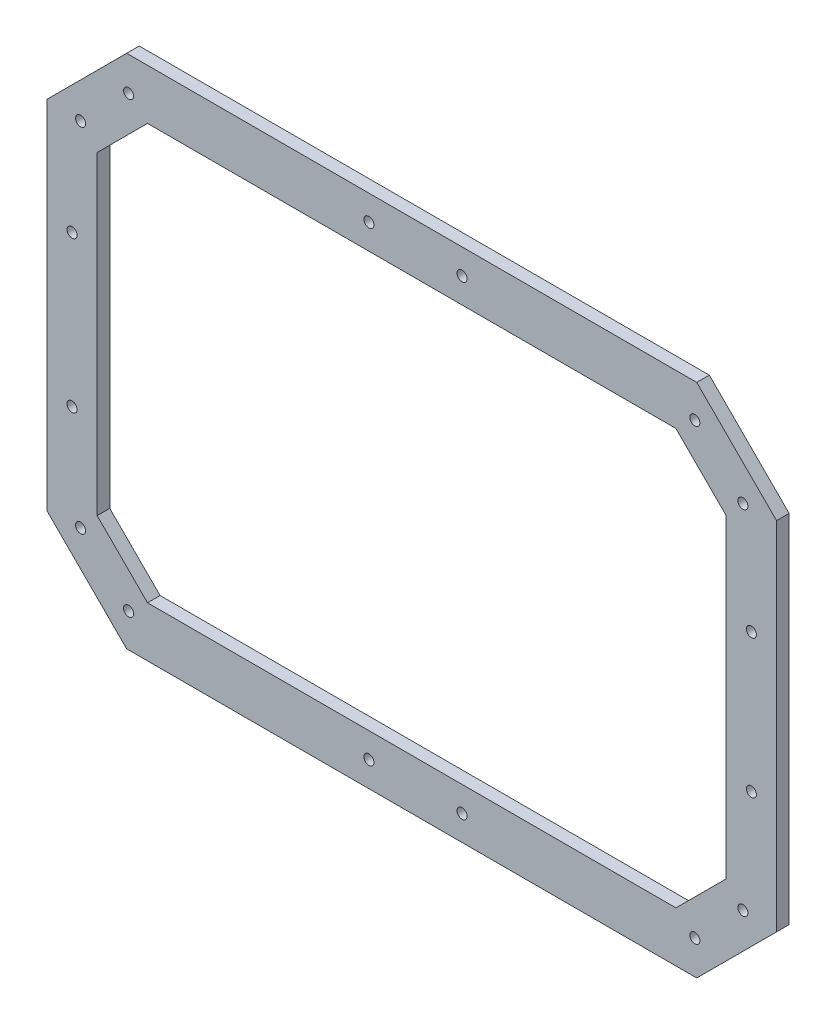
ISO-10303-21;
HEADER;
FILE_DESCRIPTION(('STEP AP214'),'2;1');
FILE_NAME('part.step','',(''),(''),'','','');
FILE_SCHEMA(('AUTOMOTIVE_DESIGN { 1 0 10303 214 1 1 1 1 }'));
ENDSEC;
DATA;
#1=APPLICATION_CONTEXT('core data for automotive mechanical design processes');
#2=APPLICATION_PROTOCOL_DEFINITION('international standard','automotive_design',2000,#1);
#3=PRODUCT_CONTEXT('',#1,'mechanical');
#4=PRODUCT('Part','Part','',(#3));
#5=PRODUCT_RELATED_PRODUCT_CATEGORY('part','',(#4));
#6=PRODUCT_DEFINITION_FORMATION('','',#4);
#7=PRODUCT_DEFINITION_CONTEXT('part definition',#1,'design');
#8=PRODUCT_DEFINITION('design','',#6,#7);
#9=PRODUCT_DEFINITION_SHAPE('','',#8);
#10=(LENGTH_UNIT() NAMED_UNIT(*) SI_UNIT(.MILLI.,.METRE.));
#11=(NAMED_UNIT(*) PLANE_ANGLE_UNIT() SI_UNIT($,.RADIAN.));
#12=(NAMED_UNIT(*) SI_UNIT($,.STERADIAN.) SOLID_ANGLE_UNIT());
#13=UNCERTAINTY_MEASURE_WITH_UNIT(LENGTH_MEASURE(1.E-05),#10,'distance_accuracy_value','');
#14=(GEOMETRIC_REPRESENTATION_CONTEXT(3) GLOBAL_UNCERTAINTY_ASSIGNED_CONTEXT((#13)) GLOBAL_UNIT_ASSIGNED_CONTEXT((#10,
#11,#12)) REPRESENTATION_CONTEXT('',''));
#15=CARTESIAN_POINT('',(0.,0.,0.));
#16=DIRECTION('',(0.,0.,1.));
#17=DIRECTION('',(1.,0.,0.));
#18=AXIS2_PLACEMENT_3D('',#15,#16,#17);
#19=CARTESIAN_POINT('',(140.987731288548,0.,5.));
#20=DIRECTION('',(1.,0.,0.));
#21=DIRECTION('',(0.,1.,0.));
#22=AXIS2_PLACEMENT_3D('',#19,#20,#21);
#23=PLANE('',#22);
#24=DIRECTION('',(0.,-1.,0.));
#25=VECTOR('',#24,1.);
#26=CARTESIAN_POINT('',(140.987731288548,0.,0.));
#27=LINE('',#26,#25);
#28=CARTESIAN_POINT('',(140.987731288548,65.6162527087848,0.));
#29=VERTEX_POINT('',#28);
#30=CARTESIAN_POINT('',(140.987731288548,-59.3837472912151,0.));
#31=VERTEX_POINT('',#30);
#32=EDGE_CURVE('E262',#29,#31,#27,.T.);
#33=ORIENTED_EDGE('',*,*,#32,.T.);
#34=DIRECTION('',(0.,0.,-1.));
#35=VECTOR('',#34,1.);
#36=CARTESIAN_POINT('',(140.987731288548,-59.3837472912151,5.));
#37=LINE('',#36,#35);
#38=CARTESIAN_POINT('',(140.987731288548,-59.3837472912151,5.));
#39=VERTEX_POINT('',#38);
#40=EDGE_CURVE('E11',#39,#31,#37,.T.);
#41=ORIENTED_EDGE('',*,*,#40,.F.);
#42=DIRECTION('',(0.,-1.,0.));
#43=VECTOR('',#42,1.);
#44=CARTESIAN_POINT('',(140.987731288548,0.,5.));
#45=LINE('',#44,#43);
#46=CARTESIAN_POINT('',(140.987731288548,65.6162527087848,5.));
#47=VERTEX_POINT('',#46);
#48=EDGE_CURVE('E390',#47,#39,#45,.T.);
#49=ORIENTED_EDGE('',*,*,#48,.F.);
#50=DIRECTION('',(0.,0.,-1.));
#51=VECTOR('',#50,1.);
#52=CARTESIAN_POINT('',(140.987731288548,65.6162527087848,5.));
#53=LINE('',#52,#51);
#54=EDGE_CURVE('E57',#47,#29,#53,.T.);
#55=ORIENTED_EDGE('',*,*,#54,.T.);
#56=EDGE_LOOP('',(#33,#41,#49,#55));
#57=FACE_BOUND('',#56,.T.);
#58=ADVANCED_FACE('F38',(#57),#23,.F.);
#59=CARTESIAN_POINT('',(100.185739289882,-100.185739289882,5.));
#60=DIRECTION('',(0.707106781186549,-0.707106781186546,0.));
#61=DIRECTION('',(0.707106781186546,0.707106781186549,0.));
#62=AXIS2_PLACEMENT_3D('',#59,#60,#61);
#63=PLANE('',#62);
#64=DIRECTION('',(-0.707106781186546,-0.707106781186549,0.));
#65=VECTOR('',#64,1.);
#66=CARTESIAN_POINT('',(100.185739289882,-100.185739289882,0.));
#67=LINE('',#66,#65);
#68=CARTESIAN_POINT('',(120.987731288548,-79.3837472912151,0.));
#69=VERTEX_POINT('',#68);
#70=EDGE_CURVE('E264',#31,#69,#67,.T.);
#71=ORIENTED_EDGE('',*,*,#70,.T.);
#72=DIRECTION('',(0.,0.,-1.));
#73=VECTOR('',#72,1.);
#74=CARTESIAN_POINT('',(120.987731288548,-79.3837472912151,5.));
#75=LINE('',#74,#73);
#76=CARTESIAN_POINT('',(120.987731288548,-79.3837472912151,5.));
#77=VERTEX_POINT('',#76);
#78=EDGE_CURVE('E48',#77,#69,#75,.T.);
#79=ORIENTED_EDGE('',*,*,#78,.F.);
#80=DIRECTION('',(-0.707106781186546,-0.707106781186549,0.));
#81=VECTOR('',#80,1.);
#82=CARTESIAN_POINT('',(100.185739289882,-100.185739289882,5.));
#83=LINE('',#82,#81);
#84=EDGE_CURVE('E392',#39,#77,#83,.T.);
#85=ORIENTED_EDGE('',*,*,#84,.F.);
#86=ORIENTED_EDGE('',*,*,#40,.T.);
#87=EDGE_LOOP('',(#71,#79,#85,#86));
#88=FACE_BOUND('',#87,.T.);
#89=ADVANCED_FACE('F423',(#88),#63,.F.);
#90=CARTESIAN_POINT('',(0.,-79.3837472912152,5.));
#91=DIRECTION('',(0.,-1.,0.));
#92=DIRECTION('',(1.,0.,0.));
#93=AXIS2_PLACEMENT_3D('',#90,#91,#92);
#94=PLANE('',#93);
#95=DIRECTION('',(-1.,0.,0.));
#96=VECTOR('',#95,1.);
#97=CARTESIAN_POINT('',(0.,-79.3837472912152,0.));
#98=LINE('',#97,#96);
#99=CARTESIAN_POINT('',(-89.0122687114519,-79.3837472912152,0.));
#100=VERTEX_POINT('',#99);
#101=EDGE_CURVE('E266',#69,#100,#98,.T.);
#102=ORIENTED_EDGE('',*,*,#101,.T.);
#103=DIRECTION('',(0.,0.,-1.));
#104=VECTOR('',#103,1.);
#105=CARTESIAN_POINT('',(-89.0122687114519,-79.3837472912152,5.));
#106=LINE('',#105,#104);
#107=CARTESIAN_POINT('',(-89.0122687114519,-79.3837472912152,5.));
#108=VERTEX_POINT('',#107);
#109=EDGE_CURVE('E334',#108,#100,#106,.T.);
#110=ORIENTED_EDGE('',*,*,#109,.F.);
#111=DIRECTION('',(-1.,0.,0.));
#112=VECTOR('',#111,1.);
#113=CARTESIAN_POINT('',(0.,-79.3837472912152,5.));
#114=LINE('',#113,#112);
#115=EDGE_CURVE('E394',#77,#108,#114,.T.);
#116=ORIENTED_EDGE('',*,*,#115,.F.);
#117=ORIENTED_EDGE('',*,*,#78,.T.);
#118=EDGE_LOOP('',(#102,#110,#116,#117));
#119=FACE_BOUND('',#118,.T.);
#120=ADVANCED_FACE('F428',(#119),#94,.F.);
#121=CARTESIAN_POINT('',(-84.1980080013334,-84.1980080013336,5.));
#122=DIRECTION('',(-0.707106781186547,-0.707106781186548,0.));
#123=DIRECTION('',(0.707106781186548,-0.707106781186547,0.));
#124=AXIS2_PLACEMENT_3D('',#121,#122,#123);
#125=PLANE('',#124);
#126=DIRECTION('',(-0.707106781186548,0.707106781186547,0.));
#127=VECTOR('',#126,1.);
#128=CARTESIAN_POINT('',(-84.1980080013334,-84.1980080013336,0.));
#129=LINE('',#128,#127);
#130=CARTESIAN_POINT('',(-109.012268711452,-59.3837472912152,0.));
#131=VERTEX_POINT('',#130);
#132=EDGE_CURVE('E268',#100,#131,#129,.T.);
#133=ORIENTED_EDGE('',*,*,#132,.T.);
#134=DIRECTION('',(0.,0.,-1.));
#135=VECTOR('',#134,1.);
#136=CARTESIAN_POINT('',(-109.012268711452,-59.3837472912152,5.));
#137=LINE('',#136,#135);
#138=CARTESIAN_POINT('',(-109.012268711452,-59.3837472912152,5.));
#139=VERTEX_POINT('',#138);
#140=EDGE_CURVE('E332',#139,#131,#137,.T.);
#141=ORIENTED_EDGE('',*,*,#140,.F.);
#142=DIRECTION('',(-0.707106781186548,0.707106781186547,0.));
#143=VECTOR('',#142,1.);
#144=CARTESIAN_POINT('',(-84.1980080013334,-84.1980080013336,5.));
#145=LINE('',#144,#143);
#146=EDGE_CURVE('E184',#108,#139,#145,.T.);
#147=ORIENTED_EDGE('',*,*,#146,.F.);
#148=ORIENTED_EDGE('',*,*,#109,.T.);
#149=EDGE_LOOP('',(#133,#141,#147,#148));
#150=FACE_BOUND('',#149,.T.);
#151=ADVANCED_FACE('F400',(#150),#125,.F.);
#152=CARTESIAN_POINT('',(-109.012268711452,0.,5.));
#153=DIRECTION('',(1.,0.,0.));
#154=DIRECTION('',(0.,1.,0.));
#155=AXIS2_PLACEMENT_3D('',#152,#153,#154);
#156=PLANE('',#155);
#157=DIRECTION('',(0.,-1.,0.));
#158=VECTOR('',#157,1.);
#159=CARTESIAN_POINT('',(-109.012268711452,0.,0.));
#160=LINE('',#159,#158);
#161=CARTESIAN_POINT('',(-109.012268711452,65.6162527087849,0.));
#162=VERTEX_POINT('',#161);
#163=EDGE_CURVE('E271',#162,#131,#160,.T.);
#164=ORIENTED_EDGE('',*,*,#163,.F.);
#165=DIRECTION('',(0.,0.,-1.));
#166=VECTOR('',#165,1.);
#167=CARTESIAN_POINT('',(-109.012268711452,65.6162527087849,5.));
#168=LINE('',#167,#166);
#169=CARTESIAN_POINT('',(-109.012268711452,65.6162527087849,5.));
#170=VERTEX_POINT('',#169);
#171=EDGE_CURVE('E169',#170,#162,#168,.T.);
#172=ORIENTED_EDGE('',*,*,#171,.F.);
#173=DIRECTION('',(0.,-1.,0.));
#174=VECTOR('',#173,1.);
#175=CARTESIAN_POINT('',(-109.012268711452,0.,5.));
#176=LINE('',#175,#174);
#177=EDGE_CURVE('E182',#170,#139,#176,.T.);
#178=ORIENTED_EDGE('',*,*,#177,.T.);
#179=ORIENTED_EDGE('',*,*,#140,.T.);
#180=EDGE_LOOP('',(#164,#172,#178,#179));
#181=FACE_BOUND('',#180,.T.);
#182=ADVANCED_FACE('F404',(#181),#156,.T.);
#183=CARTESIAN_POINT('',(-87.3142607101177,87.3142607101188,5.));
#184=DIRECTION('',(0.707106781186543,-0.707106781186552,0.));
#185=DIRECTION('',(0.707106781186552,0.707106781186543,0.));
#186=AXIS2_PLACEMENT_3D('',#183,#184,#185);
#187=PLANE('',#186);
#188=DIRECTION('',(-0.707106781186552,-0.707106781186543,0.));
#189=VECTOR('',#188,1.);
#190=CARTESIAN_POINT('',(-87.3142607101177,87.3142607101188,0.));
#191=LINE('',#190,#189);
#192=CARTESIAN_POINT('',(-89.0122687114519,85.6162527087848,0.));
#193=VERTEX_POINT('',#192);
#194=EDGE_CURVE('E166',#193,#162,#191,.T.);
#195=ORIENTED_EDGE('',*,*,#194,.F.);
#196=DIRECTION('',(0.,0.,-1.));
#197=VECTOR('',#196,1.);
#198=CARTESIAN_POINT('',(-89.0122687114519,85.6162527087848,5.));
#199=LINE('',#198,#197);
#200=CARTESIAN_POINT('',(-89.0122687114519,85.6162527087848,5.));
#201=VERTEX_POINT('',#200);
#202=EDGE_CURVE('E160',#201,#193,#199,.T.);
#203=ORIENTED_EDGE('',*,*,#202,.F.);
#204=DIRECTION('',(-0.707106781186552,-0.707106781186543,0.));
#205=VECTOR('',#204,1.);
#206=CARTESIAN_POINT('',(-87.3142607101177,87.3142607101188,5.));
#207=LINE('',#206,#205);
#208=EDGE_CURVE('E164',#201,#170,#207,.T.);
#209=ORIENTED_EDGE('',*,*,#208,.T.);
#210=ORIENTED_EDGE('',*,*,#171,.T.);
#211=EDGE_LOOP('',(#195,#203,#209,#210));
#212=FACE_BOUND('',#211,.T.);
#213=ADVANCED_FACE('F162',(#212),#187,.T.);
#214=CARTESIAN_POINT('',(0.,85.6162527087848,5.));
#215=DIRECTION('',(0.,1.,0.));
#216=DIRECTION('',(0.,0.,1.));
#217=AXIS2_PLACEMENT_3D('',#214,#215,#216);
#218=PLANE('',#217);
#219=DIRECTION('',(1.,0.,0.));
#220=VECTOR('',#219,1.);
#221=CARTESIAN_POINT('',(0.,85.6162527087848,0.));
#222=LINE('',#221,#220);
#223=CARTESIAN_POINT('',(120.987731288548,85.6162527087848,0.));
#224=VERTEX_POINT('',#223);
#225=EDGE_CURVE('E275',#193,#224,#222,.T.);
#226=ORIENTED_EDGE('',*,*,#225,.T.);
#227=DIRECTION('',(0.,0.,-1.));
#228=VECTOR('',#227,1.);
#229=CARTESIAN_POINT('',(120.987731288548,85.6162527087848,5.));
#230=LINE('',#229,#228);
#231=CARTESIAN_POINT('',(120.987731288548,85.6162527087848,5.));
#232=VERTEX_POINT('',#231);
#233=EDGE_CURVE('E108',#232,#224,#230,.T.);
#234=ORIENTED_EDGE('',*,*,#233,.F.);
#235=DIRECTION('',(1.,0.,0.));
#236=VECTOR('',#235,1.);
#237=CARTESIAN_POINT('',(0.,85.6162527087848,5.));
#238=LINE('',#237,#236);
#239=EDGE_CURVE('E171',#201,#232,#238,.T.);
#240=ORIENTED_EDGE('',*,*,#239,.F.);
#241=ORIENTED_EDGE('',*,*,#202,.T.);
#242=EDGE_LOOP('',(#226,#234,#240,#241));
#243=FACE_BOUND('',#242,.T.);
#244=ADVANCED_FACE('F172',(#243),#218,.F.);
#245=CARTESIAN_POINT('',(160.987731288548,0.,5.));
#246=DIRECTION('',(1.,0.,0.));
#247=DIRECTION('',(0.,1.,0.));
#248=AXIS2_PLACEMENT_3D('',#245,#246,#247);
#249=PLANE('',#248);
#250=DIRECTION('',(0.,-1.,0.));
#251=VECTOR('',#250,1.);
#252=CARTESIAN_POINT('',(160.987731288548,0.,0.));
#253=LINE('',#252,#251);
#254=CARTESIAN_POINT('',(160.987731288548,73.9005239562468,0.));
#255=VERTEX_POINT('',#254);
#256=CARTESIAN_POINT('',(160.987731288548,-67.6680185386771,0.));
#257=VERTEX_POINT('',#256);
#258=EDGE_CURVE('E238',#255,#257,#253,.T.);
#259=ORIENTED_EDGE('',*,*,#258,.F.);
#260=DIRECTION('',(0.,0.,-1.));
#261=VECTOR('',#260,1.);
#262=CARTESIAN_POINT('',(160.987731288548,73.9005239562468,5.));
#263=LINE('',#262,#261);
#264=CARTESIAN_POINT('',(160.987731288548,73.9005239562468,5.));
#265=VERTEX_POINT('',#264);
#266=EDGE_CURVE('E42',#265,#255,#263,.T.);
#267=ORIENTED_EDGE('',*,*,#266,.F.);
#268=DIRECTION('',(0.,-1.,0.));
#269=VECTOR('',#268,1.);
#270=CARTESIAN_POINT('',(160.987731288548,0.,5.));
#271=LINE('',#270,#269);
#272=CARTESIAN_POINT('',(160.987731288548,-67.6680185386771,5.));
#273=VERTEX_POINT('',#272);
#274=EDGE_CURVE('E328',#265,#273,#271,.T.);
#275=ORIENTED_EDGE('',*,*,#274,.T.);
#276=DIRECTION('',(0.,0.,-1.));
#277=VECTOR('',#276,1.);
#278=CARTESIAN_POINT('',(160.987731288548,-67.6680185386771,5.));
#279=LINE('',#278,#277);
#280=EDGE_CURVE('E237',#273,#257,#279,.T.);
#281=ORIENTED_EDGE('',*,*,#280,.T.);
#282=EDGE_LOOP('',(#259,#267,#275,#281));
#283=FACE_BOUND('',#282,.T.);
#284=ADVANCED_FACE('F40',(#283),#249,.T.);
#285=CARTESIAN_POINT('',(117.444127622397,117.444127622398,5.));
#286=DIRECTION('',(0.707106781186546,0.707106781186549,0.));
#287=DIRECTION('',(-0.707106781186549,0.707106781186546,0.));
#288=AXIS2_PLACEMENT_3D('',#285,#286,#287);
#289=PLANE('',#288);
#290=DIRECTION('',(0.707106781186549,-0.707106781186546,0.));
#291=VECTOR('',#290,1.);
#292=CARTESIAN_POINT('',(117.444127622397,117.444127622398,0.));
#293=LINE('',#292,#291);
#294=CARTESIAN_POINT('',(129.27200253601,105.616252708785,0.));
#295=VERTEX_POINT('',#294);
#296=EDGE_CURVE('E241',#295,#255,#293,.T.);
#297=ORIENTED_EDGE('',*,*,#296,.F.);
#298=DIRECTION('',(0.,0.,-1.));
#299=VECTOR('',#298,1.);
#300=CARTESIAN_POINT('',(129.27200253601,105.616252708785,5.));
#301=LINE('',#300,#299);
#302=CARTESIAN_POINT('',(129.27200253601,105.616252708785,5.));
#303=VERTEX_POINT('',#302);
#304=EDGE_CURVE('E349',#303,#295,#301,.T.);
#305=ORIENTED_EDGE('',*,*,#304,.F.);
#306=DIRECTION('',(0.707106781186549,-0.707106781186546,0.));
#307=VECTOR('',#306,1.);
#308=CARTESIAN_POINT('',(117.444127622397,117.444127622398,5.));
#309=LINE('',#308,#307);
#310=EDGE_CURVE('E358',#303,#265,#309,.T.);
#311=ORIENTED_EDGE('',*,*,#310,.T.);
#312=ORIENTED_EDGE('',*,*,#266,.T.);
#313=EDGE_LOOP('',(#297,#305,#311,#312));
#314=FACE_BOUND('',#313,.T.);
#315=ADVANCED_FACE('F356',(#314),#289,.T.);
#316=CARTESIAN_POINT('',(0.,105.616252708785,5.));
#317=DIRECTION('',(0.,1.,0.));
#318=DIRECTION('',(0.,0.,1.));
#319=AXIS2_PLACEMENT_3D('',#316,#317,#318);
#320=PLANE('',#319);
#321=DIRECTION('',(1.,0.,0.));
#322=VECTOR('',#321,1.);
#323=CARTESIAN_POINT('',(0.,105.616252708785,0.));
#324=LINE('',#323,#322);
#325=CARTESIAN_POINT('',(-97.2965399589139,105.616252708785,0.));
#326=VERTEX_POINT('',#325);
#327=EDGE_CURVE('E244',#326,#295,#324,.T.);
#328=ORIENTED_EDGE('',*,*,#327,.F.);
#329=DIRECTION('',(0.,0.,-1.));
#330=VECTOR('',#329,1.);
#331=CARTESIAN_POINT('',(-97.2965399589139,105.616252708785,5.));
#332=LINE('',#331,#330);
#333=CARTESIAN_POINT('',(-97.2965399589139,105.616252708785,5.));
#334=VERTEX_POINT('',#333);
#335=EDGE_CURVE('E348',#334,#326,#332,.T.);
#336=ORIENTED_EDGE('',*,*,#335,.F.);
#337=DIRECTION('',(1.,0.,0.));
#338=VECTOR('',#337,1.);
#339=CARTESIAN_POINT('',(0.,105.616252708785,5.));
#340=LINE('',#339,#338);
#341=EDGE_CURVE('E367',#334,#303,#340,.T.);
#342=ORIENTED_EDGE('',*,*,#341,.T.);
#343=ORIENTED_EDGE('',*,*,#304,.T.);
#344=EDGE_LOOP('',(#328,#336,#342,#343));
#345=FACE_BOUND('',#344,.T.);
#346=ADVANCED_FACE('F365',(#345),#320,.T.);
#347=CARTESIAN_POINT('',(-101.456396333849,101.456396333849,5.));
#348=DIRECTION('',(-0.707106781186548,0.707106781186547,0.));
#349=DIRECTION('',(-0.707106781186547,-0.707106781186548,0.));
#350=AXIS2_PLACEMENT_3D('',#347,#348,#349);
#351=PLANE('',#350);
#352=DIRECTION('',(0.707106781186547,0.707106781186548,0.));
#353=VECTOR('',#352,1.);
#354=CARTESIAN_POINT('',(-101.456396333849,101.456396333849,0.));
#355=LINE('',#354,#353);
#356=CARTESIAN_POINT('',(-129.012268711452,73.9005239562468,0.));
#357=VERTEX_POINT('',#356);
#358=EDGE_CURVE('E247',#357,#326,#355,.T.);
#359=ORIENTED_EDGE('',*,*,#358,.F.);
#360=DIRECTION('',(0.,0.,-1.));
#361=VECTOR('',#360,1.);
#362=CARTESIAN_POINT('',(-129.012268711452,73.9005239562468,5.));
#363=LINE('',#362,#361);
#364=CARTESIAN_POINT('',(-129.012268711452,73.9005239562468,5.));
#365=VERTEX_POINT('',#364);
#366=EDGE_CURVE('E346',#365,#357,#363,.T.);
#367=ORIENTED_EDGE('',*,*,#366,.F.);
#368=DIRECTION('',(0.707106781186547,0.707106781186548,0.));
#369=VECTOR('',#368,1.);
#370=CARTESIAN_POINT('',(-101.456396333849,101.456396333849,5.));
#371=LINE('',#370,#369);
#372=EDGE_CURVE('E372',#365,#334,#371,.T.);
#373=ORIENTED_EDGE('',*,*,#372,.T.);
#374=ORIENTED_EDGE('',*,*,#335,.T.);
#375=EDGE_LOOP('',(#359,#367,#373,#374));
#376=FACE_BOUND('',#375,.T.);
#377=ADVANCED_FACE('F374',(#376),#351,.T.);
#378=CARTESIAN_POINT('',(-129.012268711452,0.,5.));
#379=DIRECTION('',(1.,0.,0.));
#380=DIRECTION('',(0.,0.,-1.));
#381=AXIS2_PLACEMENT_3D('',#378,#379,#380);
#382=PLANE('',#381);
#383=DIRECTION('',(0.,-1.,0.));
#384=VECTOR('',#383,1.);
#385=CARTESIAN_POINT('',(-129.012268711452,0.,0.));
#386=LINE('',#385,#384);
#387=CARTESIAN_POINT('',(-129.012268711452,-67.6680185386772,0.));
#388=VERTEX_POINT('',#387);
#389=EDGE_CURVE('E250',#357,#388,#386,.T.);
#390=ORIENTED_EDGE('',*,*,#389,.T.);
#391=DIRECTION('',(0.,0.,-1.));
#392=VECTOR('',#391,1.);
#393=CARTESIAN_POINT('',(-129.012268711452,-67.6680185386772,5.));
#394=LINE('',#393,#392);
#395=CARTESIAN_POINT('',(-129.012268711452,-67.6680185386772,5.));
#396=VERTEX_POINT('',#395);
#397=EDGE_CURVE('E344',#396,#388,#394,.T.);
#398=ORIENTED_EDGE('',*,*,#397,.F.);
#399=DIRECTION('',(0.,-1.,0.));
#400=VECTOR('',#399,1.);
#401=CARTESIAN_POINT('',(-129.012268711452,0.,5.));
#402=LINE('',#401,#400);
#403=EDGE_CURVE('E376',#365,#396,#402,.T.);
#404=ORIENTED_EDGE('',*,*,#403,.F.);
#405=ORIENTED_EDGE('',*,*,#366,.T.);
#406=EDGE_LOOP('',(#390,#398,#404,#405));
#407=FACE_BOUND('',#406,.T.);
#408=ADVANCED_FACE('F441',(#407),#382,.F.);
#409=CARTESIAN_POINT('',(-98.3401436250644,-98.3401436250646,5.));
#410=DIRECTION('',(-0.707106781186547,-0.707106781186549,0.));
#411=DIRECTION('',(0.707106781186549,-0.707106781186547,0.));
#412=AXIS2_PLACEMENT_3D('',#409,#410,#411);
#413=PLANE('',#412);
#414=DIRECTION('',(-0.707106781186549,0.707106781186547,0.));
#415=VECTOR('',#414,1.);
#416=CARTESIAN_POINT('',(-98.3401436250644,-98.3401436250646,0.));
#417=LINE('',#416,#415);
#418=CARTESIAN_POINT('',(-97.2965399589138,-99.3837472912152,0.));
#419=VERTEX_POINT('',#418);
#420=EDGE_CURVE('E253',#419,#388,#417,.T.);
#421=ORIENTED_EDGE('',*,*,#420,.F.);
#422=DIRECTION('',(0.,0.,-1.));
#423=VECTOR('',#422,1.);
#424=CARTESIAN_POINT('',(-97.2965399589138,-99.3837472912152,5.));
#425=LINE('',#424,#423);
#426=CARTESIAN_POINT('',(-97.2965399589138,-99.3837472912152,5.));
#427=VERTEX_POINT('',#426);
#428=EDGE_CURVE('E342',#427,#419,#425,.T.);
#429=ORIENTED_EDGE('',*,*,#428,.F.);
#430=DIRECTION('',(-0.707106781186549,0.707106781186547,0.));
#431=VECTOR('',#430,1.);
#432=CARTESIAN_POINT('',(-98.3401436250644,-98.3401436250646,5.));
#433=LINE('',#432,#431);
#434=EDGE_CURVE('E378',#427,#396,#433,.T.);
#435=ORIENTED_EDGE('',*,*,#434,.T.);
#436=ORIENTED_EDGE('',*,*,#397,.T.);
#437=EDGE_LOOP('',(#421,#429,#435,#436));
#438=FACE_BOUND('',#437,.T.);
#439=ADVANCED_FACE('F437',(#438),#413,.T.);
#440=CARTESIAN_POINT('',(0.,-99.3837472912151,5.));
#441=DIRECTION('',(0.,-1.,0.));
#442=DIRECTION('',(1.,0.,0.));
#443=AXIS2_PLACEMENT_3D('',#440,#441,#442);
#444=PLANE('',#443);
#445=DIRECTION('',(-1.,0.,0.));
#446=VECTOR('',#445,1.);
#447=CARTESIAN_POINT('',(0.,-99.3837472912151,0.));
#448=LINE('',#447,#446);
#449=CARTESIAN_POINT('',(129.27200253601,-99.3837472912151,0.));
#450=VERTEX_POINT('',#449);
#451=EDGE_CURVE('E256',#450,#419,#448,.T.);
#452=ORIENTED_EDGE('',*,*,#451,.F.);
#453=DIRECTION('',(0.,0.,-1.));
#454=VECTOR('',#453,1.);
#455=CARTESIAN_POINT('',(129.27200253601,-99.3837472912151,5.));
#456=LINE('',#455,#454);
#457=CARTESIAN_POINT('',(129.27200253601,-99.3837472912151,5.));
#458=VERTEX_POINT('',#457);
#459=EDGE_CURVE('E340',#458,#450,#456,.T.);
#460=ORIENTED_EDGE('',*,*,#459,.F.);
#461=DIRECTION('',(-1.,0.,0.));
#462=VECTOR('',#461,1.);
#463=CARTESIAN_POINT('',(0.,-99.3837472912151,5.));
#464=LINE('',#463,#462);
#465=EDGE_CURVE('E384',#458,#427,#464,.T.);
#466=ORIENTED_EDGE('',*,*,#465,.T.);
#467=ORIENTED_EDGE('',*,*,#428,.T.);
#468=EDGE_LOOP('',(#452,#460,#466,#467));
#469=FACE_BOUND('',#468,.T.);
#470=ADVANCED_FACE('F433',(#469),#444,.T.);
#471=CARTESIAN_POINT('',(150.987731288548,-24.3837472912151,5.));
#472=DIRECTION('',(0.,0.,-1.));
#473=DIRECTION('',(-1.,0.,0.));
#474=AXIS2_PLACEMENT_3D('',#471,#472,#473);
#475=CYLINDRICAL_SURFACE('',#474,2.);
#476=CARTESIAN_POINT('',(150.987731288548,-24.3837472912151,5.));
#477=DIRECTION('',(0.,0.,1.));
#478=DIRECTION('',(1.,0.,0.));
#479=AXIS2_PLACEMENT_3D('',#476,#477,#478);
#480=CIRCLE('',#479,2.);
#481=CARTESIAN_POINT('',(152.987731288548,-24.3837472912151,5.));
#482=VERTEX_POINT('',#481);
#483=EDGE_CURVE('E231',#482,#482,#480,.T.);
#484=ORIENTED_EDGE('',*,*,#483,.T.);
#485=EDGE_LOOP('',(#484));
#486=FACE_BOUND('',#485,.T.);
#487=CARTESIAN_POINT('',(150.987731288548,-24.3837472912151,0.));
#488=DIRECTION('',(0.,0.,1.));
#489=DIRECTION('',(1.,0.,0.));
#490=AXIS2_PLACEMENT_3D('',#487,#488,#489);
#491=CIRCLE('',#490,2.);
#492=CARTESIAN_POINT('',(152.987731288548,-24.3837472912151,0.));
#493=VERTEX_POINT('',#492);
#494=EDGE_CURVE('E322',#493,#493,#491,.T.);
#495=ORIENTED_EDGE('',*,*,#494,.F.);
#496=EDGE_LOOP('',(#495));
#497=FACE_BOUND('',#496,.T.);
#498=ADVANCED_FACE('F436',(#486,#497),#475,.F.);
#499=CARTESIAN_POINT('',(147.604740646432,73.1413789746319,5.));
#500=DIRECTION('',(0.,0.,-1.));
#501=DIRECTION('',(-1.,0.,0.));
#502=AXIS2_PLACEMENT_3D('',#499,#500,#501);
#503=CYLINDRICAL_SURFACE('',#502,2.);
#504=CARTESIAN_POINT('',(147.604740646432,73.1413789746319,5.));
#505=DIRECTION('',(0.,0.,1.));
#506=DIRECTION('',(1.,0.,0.));
#507=AXIS2_PLACEMENT_3D('',#504,#505,#506);
#508=CIRCLE('',#507,2.);
#509=CARTESIAN_POINT('',(149.604740646432,73.1413789746319,5.));
#510=VERTEX_POINT('',#509);
#511=EDGE_CURVE('E228',#510,#510,#508,.T.);
#512=ORIENTED_EDGE('',*,*,#511,.T.);
#513=EDGE_LOOP('',(#512));
#514=FACE_BOUND('',#513,.T.);
#515=CARTESIAN_POINT('',(147.604740646432,73.1413789746319,0.));
#516=DIRECTION('',(0.,0.,1.));
#517=DIRECTION('',(1.,0.,0.));
#518=AXIS2_PLACEMENT_3D('',#515,#516,#517);
#519=CIRCLE('',#518,2.);
#520=CARTESIAN_POINT('',(149.604740646432,73.1413789746319,0.));
#521=VERTEX_POINT('',#520);
#522=EDGE_CURVE('E319',#521,#521,#519,.T.);
#523=ORIENTED_EDGE('',*,*,#522,.F.);
#524=EDGE_LOOP('',(#523));
#525=FACE_BOUND('',#524,.T.);
#526=ADVANCED_FACE('F537',(#514,#525),#503,.F.);
#527=CARTESIAN_POINT('',(128.512857554395,92.2332620666687,5.));
#528=DIRECTION('',(0.,0.,-1.));
#529=DIRECTION('',(-1.,0.,0.));
#530=AXIS2_PLACEMENT_3D('',#527,#528,#529);
#531=CYLINDRICAL_SURFACE('',#530,2.);
#532=CARTESIAN_POINT('',(128.512857554395,92.2332620666687,5.));
#533=DIRECTION('',(0.,0.,1.));
#534=DIRECTION('',(1.,0.,0.));
#535=AXIS2_PLACEMENT_3D('',#532,#533,#534);
#536=CIRCLE('',#535,2.);
#537=CARTESIAN_POINT('',(130.512857554395,92.2332620666687,5.));
#538=VERTEX_POINT('',#537);
#539=EDGE_CURVE('E225',#538,#538,#536,.T.);
#540=ORIENTED_EDGE('',*,*,#539,.T.);
#541=EDGE_LOOP('',(#540));
#542=FACE_BOUND('',#541,.T.);
#543=CARTESIAN_POINT('',(128.512857554395,92.2332620666687,0.));
#544=DIRECTION('',(0.,0.,1.));
#545=DIRECTION('',(1.,0.,0.));
#546=AXIS2_PLACEMENT_3D('',#543,#544,#545);
#547=CIRCLE('',#546,2.);
#548=CARTESIAN_POINT('',(130.512857554395,92.2332620666687,0.));
#549=VERTEX_POINT('',#548);
#550=EDGE_CURVE('E316',#549,#549,#547,.T.);
#551=ORIENTED_EDGE('',*,*,#550,.F.);
#552=EDGE_LOOP('',(#551));
#553=FACE_BOUND('',#552,.T.);
#554=ADVANCED_FACE('F547',(#542,#553),#531,.F.);
#555=CARTESIAN_POINT('',(147.604740646432,-66.9088735570623,5.));
#556=DIRECTION('',(0.,0.,-1.));
#557=DIRECTION('',(-1.,0.,0.));
#558=AXIS2_PLACEMENT_3D('',#555,#556,#557);
#559=CYLINDRICAL_SURFACE('',#558,2.00000000000002);
#560=CARTESIAN_POINT('',(147.604740646432,-66.9088735570623,5.));
#561=DIRECTION('',(0.,0.,1.));
#562=DIRECTION('',(1.,0.,0.));
#563=AXIS2_PLACEMENT_3D('',#560,#561,#562);
#564=CIRCLE('',#563,2.00000000000002);
#565=CARTESIAN_POINT('',(149.604740646432,-66.9088735570623,5.));
#566=VERTEX_POINT('',#565);
#567=EDGE_CURVE('E222',#566,#566,#564,.T.);
#568=ORIENTED_EDGE('',*,*,#567,.T.);
#569=EDGE_LOOP('',(#568));
#570=FACE_BOUND('',#569,.T.);
#571=CARTESIAN_POINT('',(147.604740646432,-66.9088735570623,0.));
#572=DIRECTION('',(0.,0.,1.));
#573=DIRECTION('',(1.,0.,0.));
#574=AXIS2_PLACEMENT_3D('',#571,#572,#573);
#575=CIRCLE('',#574,2.00000000000002);
#576=CARTESIAN_POINT('',(149.604740646432,-66.9088735570623,0.));
#577=VERTEX_POINT('',#576);
#578=EDGE_CURVE('E313',#577,#577,#575,.T.);
#579=ORIENTED_EDGE('',*,*,#578,.F.);
#580=EDGE_LOOP('',(#579));
#581=FACE_BOUND('',#580,.T.);
#582=ADVANCED_FACE('F557',(#570,#581),#559,.F.);
#583=CARTESIAN_POINT('',(128.512857554395,-86.000756649099,5.));
#584=DIRECTION('',(0.,0.,-1.));
#585=DIRECTION('',(-1.,0.,0.));
#586=AXIS2_PLACEMENT_3D('',#583,#584,#585);
#587=CYLINDRICAL_SURFACE('',#586,2.);
#588=CARTESIAN_POINT('',(128.512857554395,-86.000756649099,5.));
#589=DIRECTION('',(0.,0.,1.));
#590=DIRECTION('',(1.,0.,0.));
#591=AXIS2_PLACEMENT_3D('',#588,#589,#590);
#592=CIRCLE('',#591,2.);
#593=CARTESIAN_POINT('',(130.512857554395,-86.000756649099,5.));
#594=VERTEX_POINT('',#593);
#595=EDGE_CURVE('E219',#594,#594,#592,.T.);
#596=ORIENTED_EDGE('',*,*,#595,.T.);
#597=EDGE_LOOP('',(#596));
#598=FACE_BOUND('',#597,.T.);
#599=CARTESIAN_POINT('',(128.512857554395,-86.000756649099,0.));
#600=DIRECTION('',(0.,0.,1.));
#601=DIRECTION('',(1.,0.,0.));
#602=AXIS2_PLACEMENT_3D('',#599,#600,#601);
#603=CIRCLE('',#602,2.);
#604=CARTESIAN_POINT('',(130.512857554395,-86.000756649099,0.));
#605=VERTEX_POINT('',#604);
#606=EDGE_CURVE('E310',#605,#605,#603,.T.);
#607=ORIENTED_EDGE('',*,*,#606,.F.);
#608=EDGE_LOOP('',(#607));
#609=FACE_BOUND('',#608,.T.);
#610=ADVANCED_FACE('F567',(#598,#609),#587,.F.);
#611=CARTESIAN_POINT('',(35.987731288548,95.6162527087848,5.));
#612=DIRECTION('',(0.,0.,-1.));
#613=DIRECTION('',(-1.,0.,0.));
#614=AXIS2_PLACEMENT_3D('',#611,#612,#613);
#615=CYLINDRICAL_SURFACE('',#614,2.);
#616=CARTESIAN_POINT('',(35.987731288548,95.6162527087848,5.));
#617=DIRECTION('',(0.,0.,1.));
#618=DIRECTION('',(1.,0.,0.));
#619=AXIS2_PLACEMENT_3D('',#616,#617,#618);
#620=CIRCLE('',#619,2.);
#621=CARTESIAN_POINT('',(37.987731288548,95.6162527087848,5.));
#622=VERTEX_POINT('',#621);
#623=EDGE_CURVE('E216',#622,#622,#620,.T.);
#624=ORIENTED_EDGE('',*,*,#623,.T.);
#625=EDGE_LOOP('',(#624));
#626=FACE_BOUND('',#625,.T.);
#627=CARTESIAN_POINT('',(35.987731288548,95.6162527087848,0.));
#628=DIRECTION('',(0.,0.,1.));
#629=DIRECTION('',(1.,0.,0.));
#630=AXIS2_PLACEMENT_3D('',#627,#628,#629);
#631=CIRCLE('',#630,2.);
#632=CARTESIAN_POINT('',(37.987731288548,95.6162527087848,0.));
#633=VERTEX_POINT('',#632);
#634=EDGE_CURVE('E307',#633,#633,#631,.T.);
#635=ORIENTED_EDGE('',*,*,#634,.F.);
#636=EDGE_LOOP('',(#635));
#637=FACE_BOUND('',#636,.T.);
#638=ADVANCED_FACE('F577',(#626,#637),#615,.F.);
#639=CARTESIAN_POINT('',(-1.01226871145195,95.6162527087848,5.));
#640=DIRECTION('',(0.,0.,-1.));
#641=DIRECTION('',(-1.,0.,0.));
#642=AXIS2_PLACEMENT_3D('',#639,#640,#641);
#643=CYLINDRICAL_SURFACE('',#642,2.);
#644=CARTESIAN_POINT('',(-1.01226871145195,95.6162527087848,5.));
#645=DIRECTION('',(0.,0.,1.));
#646=DIRECTION('',(1.,0.,0.));
#647=AXIS2_PLACEMENT_3D('',#644,#645,#646);
#648=CIRCLE('',#647,2.);
#649=CARTESIAN_POINT('',(0.987731288548046,95.6162527087848,5.));
#650=VERTEX_POINT('',#649);
#651=EDGE_CURVE('E213',#650,#650,#648,.T.);
#652=ORIENTED_EDGE('',*,*,#651,.T.);
#653=EDGE_LOOP('',(#652));
#654=FACE_BOUND('',#653,.T.);
#655=CARTESIAN_POINT('',(-1.01226871145195,95.6162527087848,0.));
#656=DIRECTION('',(0.,0.,1.));
#657=DIRECTION('',(1.,0.,0.));
#658=AXIS2_PLACEMENT_3D('',#655,#656,#657);
#659=CIRCLE('',#658,2.);
#660=CARTESIAN_POINT('',(0.987731288548046,95.6162527087848,0.));
#661=VERTEX_POINT('',#660);
#662=EDGE_CURVE('E304',#661,#661,#659,.T.);
#663=ORIENTED_EDGE('',*,*,#662,.F.);
#664=EDGE_LOOP('',(#663));
#665=FACE_BOUND('',#664,.T.);
#666=ADVANCED_FACE('F587',(#654,#665),#643,.F.);
#667=CARTESIAN_POINT('',(35.9877312885481,-89.3837472912152,5.));
#668=DIRECTION('',(0.,0.,-1.));
#669=DIRECTION('',(-1.,0.,0.));
#670=AXIS2_PLACEMENT_3D('',#667,#668,#669);
#671=CYLINDRICAL_SURFACE('',#670,2.);
#672=CARTESIAN_POINT('',(35.9877312885481,-89.3837472912152,5.));
#673=DIRECTION('',(0.,0.,1.));
#674=DIRECTION('',(1.,0.,0.));
#675=AXIS2_PLACEMENT_3D('',#672,#673,#674);
#676=CIRCLE('',#675,2.);
#677=CARTESIAN_POINT('',(37.9877312885481,-89.3837472912152,5.));
#678=VERTEX_POINT('',#677);
#679=EDGE_CURVE('E210',#678,#678,#676,.T.);
#680=ORIENTED_EDGE('',*,*,#679,.T.);
#681=EDGE_LOOP('',(#680));
#682=FACE_BOUND('',#681,.T.);
#683=CARTESIAN_POINT('',(35.9877312885481,-89.3837472912152,0.));
#684=DIRECTION('',(0.,0.,1.));
#685=DIRECTION('',(1.,0.,0.));
#686=AXIS2_PLACEMENT_3D('',#683,#684,#685);
#687=CIRCLE('',#686,2.);
#688=CARTESIAN_POINT('',(37.9877312885481,-89.3837472912152,0.));
#689=VERTEX_POINT('',#688);
#690=EDGE_CURVE('E301',#689,#689,#687,.T.);
#691=ORIENTED_EDGE('',*,*,#690,.F.);
#692=EDGE_LOOP('',(#691));
#693=FACE_BOUND('',#692,.T.);
#694=ADVANCED_FACE('F597',(#682,#693),#671,.F.);
#695=CARTESIAN_POINT('',(-96.537394977299,92.2332620666687,5.));
#696=DIRECTION('',(0.,0.,-1.));
#697=DIRECTION('',(-1.,0.,0.));
#698=AXIS2_PLACEMENT_3D('',#695,#696,#697);
#699=CYLINDRICAL_SURFACE('',#698,2.);
#700=CARTESIAN_POINT('',(-96.537394977299,92.2332620666687,5.));
#701=DIRECTION('',(0.,0.,1.));
#702=DIRECTION('',(1.,0.,0.));
#703=AXIS2_PLACEMENT_3D('',#700,#701,#702);
#704=CIRCLE('',#703,2.);
#705=CARTESIAN_POINT('',(-94.537394977299,92.2332620666687,5.));
#706=VERTEX_POINT('',#705);
#707=EDGE_CURVE('E207',#706,#706,#704,.T.);
#708=ORIENTED_EDGE('',*,*,#707,.T.);
#709=EDGE_LOOP('',(#708));
#710=FACE_BOUND('',#709,.T.);
#711=CARTESIAN_POINT('',(-96.537394977299,92.2332620666687,0.));
#712=DIRECTION('',(0.,0.,1.));
#713=DIRECTION('',(1.,0.,0.));
#714=AXIS2_PLACEMENT_3D('',#711,#712,#713);
#715=CIRCLE('',#714,2.);
#716=CARTESIAN_POINT('',(-94.537394977299,92.2332620666687,0.));
#717=VERTEX_POINT('',#716);
#718=EDGE_CURVE('E298',#717,#717,#715,.T.);
#719=ORIENTED_EDGE('',*,*,#718,.F.);
#720=EDGE_LOOP('',(#719));
#721=FACE_BOUND('',#720,.T.);
#722=ADVANCED_FACE('F607',(#710,#721),#699,.F.);
#723=CARTESIAN_POINT('',(-1.01226871145188,-89.3837472912151,5.));
#724=DIRECTION('',(0.,0.,-1.));
#725=DIRECTION('',(-1.,0.,0.));
#726=AXIS2_PLACEMENT_3D('',#723,#724,#725);
#727=CYLINDRICAL_SURFACE('',#726,2.);
#728=CARTESIAN_POINT('',(-1.01226871145188,-89.3837472912151,5.));
#729=DIRECTION('',(0.,0.,1.));
#730=DIRECTION('',(1.,0.,0.));
#731=AXIS2_PLACEMENT_3D('',#728,#729,#730);
#732=CIRCLE('',#731,2.);
#733=CARTESIAN_POINT('',(0.98773128854812,-89.3837472912151,5.));
#734=VERTEX_POINT('',#733);
#735=EDGE_CURVE('E204',#734,#734,#732,.T.);
#736=ORIENTED_EDGE('',*,*,#735,.T.);
#737=EDGE_LOOP('',(#736));
#738=FACE_BOUND('',#737,.T.);
#739=CARTESIAN_POINT('',(-1.01226871145188,-89.3837472912151,0.));
#740=DIRECTION('',(0.,0.,1.));
#741=DIRECTION('',(1.,0.,0.));
#742=AXIS2_PLACEMENT_3D('',#739,#740,#741);
#743=CIRCLE('',#742,2.);
#744=CARTESIAN_POINT('',(0.98773128854812,-89.3837472912151,0.));
#745=VERTEX_POINT('',#744);
#746=EDGE_CURVE('E295',#745,#745,#743,.T.);
#747=ORIENTED_EDGE('',*,*,#746,.F.);
#748=EDGE_LOOP('',(#747));
#749=FACE_BOUND('',#748,.T.);
#750=ADVANCED_FACE('F617',(#738,#749),#727,.F.);
#751=CARTESIAN_POINT('',(-115.629278069336,73.1413789746319,5.));
#752=DIRECTION('',(0.,0.,-1.));
#753=DIRECTION('',(-1.,0.,0.));
#754=AXIS2_PLACEMENT_3D('',#751,#752,#753);
#755=CYLINDRICAL_SURFACE('',#754,2.);
#756=CARTESIAN_POINT('',(-115.629278069336,73.1413789746319,5.));
#757=DIRECTION('',(0.,0.,1.));
#758=DIRECTION('',(1.,0.,0.));
#759=AXIS2_PLACEMENT_3D('',#756,#757,#758);
#760=CIRCLE('',#759,2.);
#761=CARTESIAN_POINT('',(-113.629278069336,73.1413789746319,5.));
#762=VERTEX_POINT('',#761);
#763=EDGE_CURVE('E201',#762,#762,#760,.T.);
#764=ORIENTED_EDGE('',*,*,#763,.T.);
#765=EDGE_LOOP('',(#764));
#766=FACE_BOUND('',#765,.T.);
#767=CARTESIAN_POINT('',(-115.629278069336,73.1413789746319,0.));
#768=DIRECTION('',(0.,0.,1.));
#769=DIRECTION('',(1.,0.,0.));
#770=AXIS2_PLACEMENT_3D('',#767,#768,#769);
#771=CIRCLE('',#770,2.);
#772=CARTESIAN_POINT('',(-113.629278069336,73.1413789746319,0.));
#773=VERTEX_POINT('',#772);
#774=EDGE_CURVE('E292',#773,#773,#771,.T.);
#775=ORIENTED_EDGE('',*,*,#774,.F.);
#776=EDGE_LOOP('',(#775));
#777=FACE_BOUND('',#776,.T.);
#778=ADVANCED_FACE('F627',(#766,#777),#755,.F.);
#779=CARTESIAN_POINT('',(-96.537394977299,-86.0007566490991,5.));
#780=DIRECTION('',(0.,0.,-1.));
#781=DIRECTION('',(-1.,0.,0.));
#782=AXIS2_PLACEMENT_3D('',#779,#780,#781);
#783=CYLINDRICAL_SURFACE('',#782,2.);
#784=CARTESIAN_POINT('',(-96.537394977299,-86.0007566490991,5.));
#785=DIRECTION('',(0.,0.,1.));
#786=DIRECTION('',(1.,0.,0.));
#787=AXIS2_PLACEMENT_3D('',#784,#785,#786);
#788=CIRCLE('',#787,2.);
#789=CARTESIAN_POINT('',(-94.537394977299,-86.0007566490991,5.));
#790=VERTEX_POINT('',#789);
#791=EDGE_CURVE('E198',#790,#790,#788,.T.);
#792=ORIENTED_EDGE('',*,*,#791,.T.);
#793=EDGE_LOOP('',(#792));
#794=FACE_BOUND('',#793,.T.);
#795=CARTESIAN_POINT('',(-96.537394977299,-86.0007566490991,0.));
#796=DIRECTION('',(0.,0.,1.));
#797=DIRECTION('',(1.,0.,0.));
#798=AXIS2_PLACEMENT_3D('',#795,#796,#797);
#799=CIRCLE('',#798,2.);
#800=CARTESIAN_POINT('',(-94.537394977299,-86.0007566490991,0.));
#801=VERTEX_POINT('',#800);
#802=EDGE_CURVE('E289',#801,#801,#799,.T.);
#803=ORIENTED_EDGE('',*,*,#802,.F.);
#804=EDGE_LOOP('',(#803));
#805=FACE_BOUND('',#804,.T.);
#806=ADVANCED_FACE('F637',(#794,#805),#783,.F.);
#807=CARTESIAN_POINT('',(-119.012268711452,33.1162527087848,5.));
#808=DIRECTION('',(0.,0.,-1.));
#809=DIRECTION('',(-1.,0.,0.));
#810=AXIS2_PLACEMENT_3D('',#807,#808,#809);
#811=CYLINDRICAL_SURFACE('',#810,2.);
#812=CARTESIAN_POINT('',(-119.012268711452,33.1162527087848,5.));
#813=DIRECTION('',(0.,0.,1.));
#814=DIRECTION('',(1.,0.,0.));
#815=AXIS2_PLACEMENT_3D('',#812,#813,#814);
#816=CIRCLE('',#815,2.);
#817=CARTESIAN_POINT('',(-117.012268711452,33.1162527087848,5.));
#818=VERTEX_POINT('',#817);
#819=EDGE_CURVE('E195',#818,#818,#816,.T.);
#820=ORIENTED_EDGE('',*,*,#819,.T.);
#821=EDGE_LOOP('',(#820));
#822=FACE_BOUND('',#821,.T.);
#823=CARTESIAN_POINT('',(-119.012268711452,33.1162527087848,0.));
#824=DIRECTION('',(0.,0.,1.));
#825=DIRECTION('',(1.,0.,0.));
#826=AXIS2_PLACEMENT_3D('',#823,#824,#825);
#827=CIRCLE('',#826,2.);
#828=CARTESIAN_POINT('',(-117.012268711452,33.1162527087848,0.));
#829=VERTEX_POINT('',#828);
#830=EDGE_CURVE('E286',#829,#829,#827,.T.);
#831=ORIENTED_EDGE('',*,*,#830,.F.);
#832=EDGE_LOOP('',(#831));
#833=FACE_BOUND('',#832,.T.);
#834=ADVANCED_FACE('F647',(#822,#833),#811,.F.);
#835=CARTESIAN_POINT('',(-119.012268711452,-26.8837472912152,5.));
#836=DIRECTION('',(0.,0.,-1.));
#837=DIRECTION('',(-1.,0.,0.));
#838=AXIS2_PLACEMENT_3D('',#835,#836,#837);
#839=CYLINDRICAL_SURFACE('',#838,2.);
#840=CARTESIAN_POINT('',(-119.012268711452,-26.8837472912152,5.));
#841=DIRECTION('',(0.,0.,1.));
#842=DIRECTION('',(1.,0.,0.));
#843=AXIS2_PLACEMENT_3D('',#840,#841,#842);
#844=CIRCLE('',#843,2.);
#845=CARTESIAN_POINT('',(-117.012268711452,-26.8837472912152,5.));
#846=VERTEX_POINT('',#845);
#847=EDGE_CURVE('E192',#846,#846,#844,.T.);
#848=ORIENTED_EDGE('',*,*,#847,.T.);
#849=EDGE_LOOP('',(#848));
#850=FACE_BOUND('',#849,.T.);
#851=CARTESIAN_POINT('',(-119.012268711452,-26.8837472912152,0.));
#852=DIRECTION('',(0.,0.,1.));
#853=DIRECTION('',(1.,0.,0.));
#854=AXIS2_PLACEMENT_3D('',#851,#852,#853);
#855=CIRCLE('',#854,2.);
#856=CARTESIAN_POINT('',(-117.012268711452,-26.8837472912152,0.));
#857=VERTEX_POINT('',#856);
#858=EDGE_CURVE('E283',#857,#857,#855,.T.);
#859=ORIENTED_EDGE('',*,*,#858,.F.);
#860=EDGE_LOOP('',(#859));
#861=FACE_BOUND('',#860,.T.);
#862=ADVANCED_FACE('F418',(#850,#861),#839,.F.);
#863=CARTESIAN_POINT('',(-115.629278069336,-66.9088735570623,5.));
#864=DIRECTION('',(0.,0.,-1.));
#865=DIRECTION('',(-1.,0.,0.));
#866=AXIS2_PLACEMENT_3D('',#863,#864,#865);
#867=CYLINDRICAL_SURFACE('',#866,2.);
#868=CARTESIAN_POINT('',(-115.629278069336,-66.9088735570623,5.));
#869=DIRECTION('',(0.,0.,1.));
#870=DIRECTION('',(1.,0.,0.));
#871=AXIS2_PLACEMENT_3D('',#868,#869,#870);
#872=CIRCLE('',#871,2.);
#873=CARTESIAN_POINT('',(-113.629278069336,-66.9088735570623,5.));
#874=VERTEX_POINT('',#873);
#875=EDGE_CURVE('E189',#874,#874,#872,.T.);
#876=ORIENTED_EDGE('',*,*,#875,.T.);
#877=EDGE_LOOP('',(#876));
#878=FACE_BOUND('',#877,.T.);
#879=CARTESIAN_POINT('',(-115.629278069336,-66.9088735570623,0.));
#880=DIRECTION('',(0.,0.,1.));
#881=DIRECTION('',(1.,0.,0.));
#882=AXIS2_PLACEMENT_3D('',#879,#880,#881);
#883=CIRCLE('',#882,2.);
#884=CARTESIAN_POINT('',(-113.629278069336,-66.9088735570623,0.));
#885=VERTEX_POINT('',#884);
#886=EDGE_CURVE('E280',#885,#885,#883,.T.);
#887=ORIENTED_EDGE('',*,*,#886,.F.);
#888=EDGE_LOOP('',(#887));
#889=FACE_BOUND('',#888,.T.);
#890=ADVANCED_FACE('F409',(#878,#889),#867,.F.);
#891=CARTESIAN_POINT('',(103.301991998666,103.301991998666,5.));
#892=DIRECTION('',(-0.707106781186548,-0.707106781186548,0.));
#893=DIRECTION('',(0.707106781186548,-0.707106781186548,0.));
#894=AXIS2_PLACEMENT_3D('',#891,#892,#893);
#895=PLANE('',#894);
#896=DIRECTION('',(-0.707106781186548,0.707106781186548,0.));
#897=VECTOR('',#896,1.);
#898=CARTESIAN_POINT('',(103.301991998666,103.301991998666,0.));
#899=LINE('',#898,#897);
#900=EDGE_CURVE('E277',#29,#224,#899,.T.);
#901=ORIENTED_EDGE('',*,*,#900,.F.);
#902=ORIENTED_EDGE('',*,*,#54,.F.);
#903=DIRECTION('',(-0.707106781186548,0.707106781186548,0.));
#904=VECTOR('',#903,1.);
#905=CARTESIAN_POINT('',(103.301991998666,103.301991998666,5.));
#906=LINE('',#905,#904);
#907=EDGE_CURVE('E175',#47,#232,#906,.T.);
#908=ORIENTED_EDGE('',*,*,#907,.T.);
#909=ORIENTED_EDGE('',*,*,#233,.T.);
#910=EDGE_LOOP('',(#901,#902,#908,#909));
#911=FACE_BOUND('',#910,.T.);
#912=ADVANCED_FACE('F406',(#911),#895,.T.);
#913=CARTESIAN_POINT('',(114.327874913613,-114.327874913613,5.));
#914=DIRECTION('',(0.707106781186548,-0.707106781186548,0.));
#915=DIRECTION('',(0.707106781186548,0.707106781186548,0.));
#916=AXIS2_PLACEMENT_3D('',#913,#914,#915);
#917=PLANE('',#916);
#918=DIRECTION('',(-0.707106781186548,-0.707106781186548,0.));
#919=VECTOR('',#918,1.);
#920=CARTESIAN_POINT('',(114.327874913613,-114.327874913613,0.));
#921=LINE('',#920,#919);
#922=EDGE_CURVE('E259',#257,#450,#921,.T.);
#923=ORIENTED_EDGE('',*,*,#922,.F.);
#924=ORIENTED_EDGE('',*,*,#280,.F.);
#925=DIRECTION('',(-0.707106781186548,-0.707106781186548,0.));
#926=VECTOR('',#925,1.);
#927=CARTESIAN_POINT('',(114.327874913613,-114.327874913613,5.));
#928=LINE('',#927,#926);
#929=EDGE_CURVE('E387',#273,#458,#928,.T.);
#930=ORIENTED_EDGE('',*,*,#929,.T.);
#931=ORIENTED_EDGE('',*,*,#459,.T.);
#932=EDGE_LOOP('',(#923,#924,#930,#931));
#933=FACE_BOUND('',#932,.T.);
#934=ADVANCED_FACE('F408',(#933),#917,.T.);
#935=CARTESIAN_POINT('',(150.987731288548,30.6162527087849,5.));
#936=DIRECTION('',(0.,0.,-1.));
#937=DIRECTION('',(-1.,0.,0.));
#938=AXIS2_PLACEMENT_3D('',#935,#936,#937);
#939=CYLINDRICAL_SURFACE('',#938,2.);
#940=CARTESIAN_POINT('',(150.987731288548,30.6162527087849,5.));
#941=DIRECTION('',(0.,0.,1.));
#942=DIRECTION('',(1.,0.,0.));
#943=AXIS2_PLACEMENT_3D('',#940,#941,#942);
#944=CIRCLE('',#943,2.);
#945=CARTESIAN_POINT('',(152.987731288548,30.6162527087849,5.));
#946=VERTEX_POINT('',#945);
#947=EDGE_CURVE('E234',#946,#946,#944,.T.);
#948=ORIENTED_EDGE('',*,*,#947,.T.);
#949=EDGE_LOOP('',(#948));
#950=FACE_BOUND('',#949,.T.);
#951=CARTESIAN_POINT('',(150.987731288548,30.6162527087849,0.));
#952=DIRECTION('',(0.,0.,1.));
#953=DIRECTION('',(1.,0.,0.));
#954=AXIS2_PLACEMENT_3D('',#951,#952,#953);
#955=CIRCLE('',#954,2.);
#956=CARTESIAN_POINT('',(152.987731288548,30.6162527087849,0.));
#957=VERTEX_POINT('',#956);
#958=EDGE_CURVE('E325',#957,#957,#955,.T.);
#959=ORIENTED_EDGE('',*,*,#958,.F.);
#960=EDGE_LOOP('',(#959));
#961=FACE_BOUND('',#960,.T.);
#962=ADVANCED_FACE('F415',(#950,#961),#939,.F.);
#963=CARTESIAN_POINT('',(0.,0.,5.));
#964=DIRECTION('',(0.,0.,1.));
#965=DIRECTION('',(1.,0.,0.));
#966=AXIS2_PLACEMENT_3D('',#963,#964,#965);
#967=PLANE('',#966);
#968=ORIENTED_EDGE('',*,*,#274,.F.);
#969=ORIENTED_EDGE('',*,*,#310,.F.);
#970=ORIENTED_EDGE('',*,*,#341,.F.);
#971=ORIENTED_EDGE('',*,*,#372,.F.);
#972=ORIENTED_EDGE('',*,*,#403,.T.);
#973=ORIENTED_EDGE('',*,*,#434,.F.);
#974=ORIENTED_EDGE('',*,*,#465,.F.);
#975=ORIENTED_EDGE('',*,*,#929,.F.);
#976=EDGE_LOOP('',(#968,#969,#970,#971,#972,#973,#974,#975));
#977=FACE_BOUND('',#976,.T.);
#978=ORIENTED_EDGE('',*,*,#48,.T.);
#979=ORIENTED_EDGE('',*,*,#84,.T.);
#980=ORIENTED_EDGE('',*,*,#115,.T.);
#981=ORIENTED_EDGE('',*,*,#146,.T.);
#982=ORIENTED_EDGE('',*,*,#177,.F.);
#983=ORIENTED_EDGE('',*,*,#208,.F.);
#984=ORIENTED_EDGE('',*,*,#239,.T.);
#985=ORIENTED_EDGE('',*,*,#907,.F.);
#986=EDGE_LOOP('',(#978,#979,#980,#981,#982,#983,#984,#985));
#987=FACE_BOUND('',#986,.T.);
#988=ORIENTED_EDGE('',*,*,#875,.F.);
#989=EDGE_LOOP('',(#988));
#990=FACE_BOUND('',#989,.T.);
#991=ORIENTED_EDGE('',*,*,#847,.F.);
#992=EDGE_LOOP('',(#991));
#993=FACE_BOUND('',#992,.T.);
#994=ORIENTED_EDGE('',*,*,#819,.F.);
#995=EDGE_LOOP('',(#994));
#996=FACE_BOUND('',#995,.T.);
#997=ORIENTED_EDGE('',*,*,#791,.F.);
#998=EDGE_LOOP('',(#997));
#999=FACE_BOUND('',#998,.T.);
#1000=ORIENTED_EDGE('',*,*,#763,.F.);
#1001=EDGE_LOOP('',(#1000));
#1002=FACE_BOUND('',#1001,.T.);
#1003=ORIENTED_EDGE('',*,*,#735,.F.);
#1004=EDGE_LOOP('',(#1003));
#1005=FACE_BOUND('',#1004,.T.);
#1006=ORIENTED_EDGE('',*,*,#707,.F.);
#1007=EDGE_LOOP('',(#1006));
#1008=FACE_BOUND('',#1007,.T.);
#1009=ORIENTED_EDGE('',*,*,#679,.F.);
#1010=EDGE_LOOP('',(#1009));
#1011=FACE_BOUND('',#1010,.T.);
#1012=ORIENTED_EDGE('',*,*,#651,.F.);
#1013=EDGE_LOOP('',(#1012));
#1014=FACE_BOUND('',#1013,.T.);
#1015=ORIENTED_EDGE('',*,*,#623,.F.);
#1016=EDGE_LOOP('',(#1015));
#1017=FACE_BOUND('',#1016,.T.);
#1018=ORIENTED_EDGE('',*,*,#595,.F.);
#1019=EDGE_LOOP('',(#1018));
#1020=FACE_BOUND('',#1019,.T.);
#1021=ORIENTED_EDGE('',*,*,#567,.F.);
#1022=EDGE_LOOP('',(#1021));
#1023=FACE_BOUND('',#1022,.T.);
#1024=ORIENTED_EDGE('',*,*,#539,.F.);
#1025=EDGE_LOOP('',(#1024));
#1026=FACE_BOUND('',#1025,.T.);
#1027=ORIENTED_EDGE('',*,*,#511,.F.);
#1028=EDGE_LOOP('',(#1027));
#1029=FACE_BOUND('',#1028,.T.);
#1030=ORIENTED_EDGE('',*,*,#483,.F.);
#1031=EDGE_LOOP('',(#1030));
#1032=FACE_BOUND('',#1031,.T.);
#1033=ORIENTED_EDGE('',*,*,#947,.F.);
#1034=EDGE_LOOP('',(#1033));
#1035=FACE_BOUND('',#1034,.T.);
#1036=ADVANCED_FACE('F179',(#977,#987,#990,#993,#996,#999,#1002,#1005,#1008,#1011,#1014,#1017,
#1020,#1023,#1026,#1029,#1032,#1035),#967,.T.);
#1037=CARTESIAN_POINT('',(0.,0.,0.));
#1038=DIRECTION('',(0.,0.,1.));
#1039=DIRECTION('',(1.,0.,0.));
#1040=AXIS2_PLACEMENT_3D('',#1037,#1038,#1039);
#1041=PLANE('',#1040);
#1042=ORIENTED_EDGE('',*,*,#258,.T.);
#1043=ORIENTED_EDGE('',*,*,#922,.T.);
#1044=ORIENTED_EDGE('',*,*,#451,.T.);
#1045=ORIENTED_EDGE('',*,*,#420,.T.);
#1046=ORIENTED_EDGE('',*,*,#389,.F.);
#1047=ORIENTED_EDGE('',*,*,#358,.T.);
#1048=ORIENTED_EDGE('',*,*,#327,.T.);
#1049=ORIENTED_EDGE('',*,*,#296,.T.);
#1050=EDGE_LOOP('',(#1042,#1043,#1044,#1045,#1046,#1047,#1048,#1049));
#1051=FACE_BOUND('',#1050,.T.);
#1052=ORIENTED_EDGE('',*,*,#32,.F.);
#1053=ORIENTED_EDGE('',*,*,#900,.T.);
#1054=ORIENTED_EDGE('',*,*,#225,.F.);
#1055=ORIENTED_EDGE('',*,*,#194,.T.);
#1056=ORIENTED_EDGE('',*,*,#163,.T.);
#1057=ORIENTED_EDGE('',*,*,#132,.F.);
#1058=ORIENTED_EDGE('',*,*,#101,.F.);
#1059=ORIENTED_EDGE('',*,*,#70,.F.);
#1060=EDGE_LOOP('',(#1052,#1053,#1054,#1055,#1056,#1057,#1058,#1059));
#1061=FACE_BOUND('',#1060,.T.);
#1062=ORIENTED_EDGE('',*,*,#886,.T.);
#1063=EDGE_LOOP('',(#1062));
#1064=FACE_BOUND('',#1063,.T.);
#1065=ORIENTED_EDGE('',*,*,#858,.T.);
#1066=EDGE_LOOP('',(#1065));
#1067=FACE_BOUND('',#1066,.T.);
#1068=ORIENTED_EDGE('',*,*,#830,.T.);
#1069=EDGE_LOOP('',(#1068));
#1070=FACE_BOUND('',#1069,.T.);
#1071=ORIENTED_EDGE('',*,*,#802,.T.);
#1072=EDGE_LOOP('',(#1071));
#1073=FACE_BOUND('',#1072,.T.);
#1074=ORIENTED_EDGE('',*,*,#774,.T.);
#1075=EDGE_LOOP('',(#1074));
#1076=FACE_BOUND('',#1075,.T.);
#1077=ORIENTED_EDGE('',*,*,#746,.T.);
#1078=EDGE_LOOP('',(#1077));
#1079=FACE_BOUND('',#1078,.T.);
#1080=ORIENTED_EDGE('',*,*,#718,.T.);
#1081=EDGE_LOOP('',(#1080));
#1082=FACE_BOUND('',#1081,.T.);
#1083=ORIENTED_EDGE('',*,*,#690,.T.);
#1084=EDGE_LOOP('',(#1083));
#1085=FACE_BOUND('',#1084,.T.);
#1086=ORIENTED_EDGE('',*,*,#662,.T.);
#1087=EDGE_LOOP('',(#1086));
#1088=FACE_BOUND('',#1087,.T.);
#1089=ORIENTED_EDGE('',*,*,#634,.T.);
#1090=EDGE_LOOP('',(#1089));
#1091=FACE_BOUND('',#1090,.T.);
#1092=ORIENTED_EDGE('',*,*,#606,.T.);
#1093=EDGE_LOOP('',(#1092));
#1094=FACE_BOUND('',#1093,.T.);
#1095=ORIENTED_EDGE('',*,*,#578,.T.);
#1096=EDGE_LOOP('',(#1095));
#1097=FACE_BOUND('',#1096,.T.);
#1098=ORIENTED_EDGE('',*,*,#550,.T.);
#1099=EDGE_LOOP('',(#1098));
#1100=FACE_BOUND('',#1099,.T.);
#1101=ORIENTED_EDGE('',*,*,#522,.T.);
#1102=EDGE_LOOP('',(#1101));
#1103=FACE_BOUND('',#1102,.T.);
#1104=ORIENTED_EDGE('',*,*,#494,.T.);
#1105=EDGE_LOOP('',(#1104));
#1106=FACE_BOUND('',#1105,.T.);
#1107=ORIENTED_EDGE('',*,*,#958,.T.);
#1108=EDGE_LOOP('',(#1107));
#1109=FACE_BOUND('',#1108,.T.);
#1110=ADVANCED_FACE('F361',(#1051,#1061,#1064,#1067,#1070,#1073,#1076,#1079,#1082,#1085,#1088,
#1091,#1094,#1097,#1100,#1103,#1106,#1109),#1041,.F.);
#1111=CLOSED_SHELL('',(#58,#89,#120,#151,#182,#213,#244,#284,#315,#346,#377,#408,#439,#470,#498,
#526,#554,#582,#610,#638,#666,#694,#722,#750,#778,#806,#834,#862,#890,#912,#934,#962,#1036,#1110));
#1112=MANIFOLD_SOLID_BREP('B2',#1111);
#1113=ADVANCED_BREP_SHAPE_REPRESENTATION('',(#18,#1112),#14);
#1114=SHAPE_DEFINITION_REPRESENTATION(#9,#1113);
ENDSEC;
END-ISO-10303-21;
